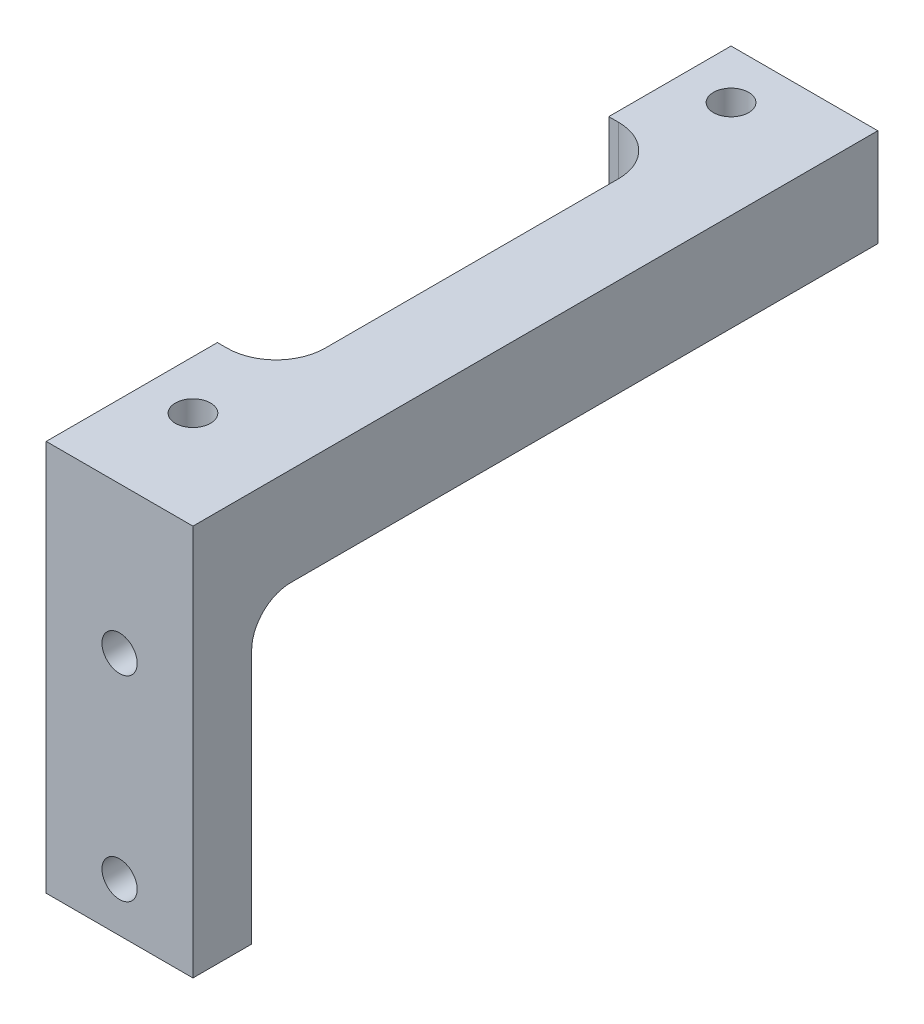
ISO-10303-21;
HEADER;
FILE_DESCRIPTION(('STEP AP214'),'2;1');
FILE_NAME('part.step','',(''),(''),'','','');
FILE_SCHEMA(('AUTOMOTIVE_DESIGN { 1 0 10303 214 1 1 1 1 }'));
ENDSEC;
DATA;
#1=APPLICATION_CONTEXT('core data for automotive mechanical design processes');
#2=APPLICATION_PROTOCOL_DEFINITION('international standard','automotive_design',2000,#1);
#3=PRODUCT_CONTEXT('',#1,'mechanical');
#4=PRODUCT('Part','Part','',(#3));
#5=PRODUCT_RELATED_PRODUCT_CATEGORY('part','',(#4));
#6=PRODUCT_DEFINITION_FORMATION('','',#4);
#7=PRODUCT_DEFINITION_CONTEXT('part definition',#1,'design');
#8=PRODUCT_DEFINITION('design','',#6,#7);
#9=PRODUCT_DEFINITION_SHAPE('','',#8);
#10=(LENGTH_UNIT() NAMED_UNIT(*) SI_UNIT(.MILLI.,.METRE.));
#11=(NAMED_UNIT(*) PLANE_ANGLE_UNIT() SI_UNIT($,.RADIAN.));
#12=(NAMED_UNIT(*) SI_UNIT($,.STERADIAN.) SOLID_ANGLE_UNIT());
#13=UNCERTAINTY_MEASURE_WITH_UNIT(LENGTH_MEASURE(1.E-05),#10,'distance_accuracy_value','');
#14=(GEOMETRIC_REPRESENTATION_CONTEXT(3) GLOBAL_UNCERTAINTY_ASSIGNED_CONTEXT((#13)) GLOBAL_UNIT_ASSIGNED_CONTEXT((#10,
#11,#12)) REPRESENTATION_CONTEXT('',''));
#15=CARTESIAN_POINT('',(0.,0.,0.));
#16=DIRECTION('',(0.,0.,1.));
#17=DIRECTION('',(1.,0.,0.));
#18=AXIS2_PLACEMENT_3D('',#15,#16,#17);
#19=CARTESIAN_POINT('',(14.2875,-12.7,44.45));
#20=DIRECTION('',(1.,0.,0.));
#21=DIRECTION('',(0.,0.,-1.));
#22=AXIS2_PLACEMENT_3D('',#19,#20,#21);
#23=PLANE('',#22);
#24=DIRECTION('',(0.,0.,-1.));
#25=VECTOR('',#24,1.);
#26=CARTESIAN_POINT('',(14.2875,12.7,44.45));
#27=LINE('',#26,#25);
#28=CARTESIAN_POINT('',(14.2875,12.7,44.45));
#29=VERTEX_POINT('',#28);
#30=CARTESIAN_POINT('',(14.2875,12.7,33.3375));
#31=VERTEX_POINT('',#30);
#32=EDGE_CURVE('E178',#29,#31,#27,.T.);
#33=ORIENTED_EDGE('',*,*,#32,.T.);
#34=DIRECTION('',(0.,-1.,0.));
#35=VECTOR('',#34,1.);
#36=CARTESIAN_POINT('',(14.2875,-12.7,33.3375));
#37=LINE('',#36,#35);
#38=CARTESIAN_POINT('',(14.2875,6.35,33.3375));
#39=VERTEX_POINT('',#38);
#40=EDGE_CURVE('E170',#31,#39,#37,.T.);
#41=ORIENTED_EDGE('',*,*,#40,.T.);
#42=DIRECTION('',(0.,0.,1.));
#43=VECTOR('',#42,1.);
#44=CARTESIAN_POINT('',(14.2875,6.35,44.45));
#45=LINE('',#44,#43);
#46=CARTESIAN_POINT('',(14.2875,6.35,38.1));
#47=VERTEX_POINT('',#46);
#48=EDGE_CURVE('E210',#39,#47,#45,.T.);
#49=ORIENTED_EDGE('',*,*,#48,.T.);
#50=CARTESIAN_POINT('',(14.2875,3.81,38.1));
#51=DIRECTION('',(1.,0.,0.));
#52=DIRECTION('',(0.,0.,-1.));
#53=AXIS2_PLACEMENT_3D('',#50,#51,#52);
#54=CIRCLE('',#53,2.54);
#55=CARTESIAN_POINT('',(14.2875,3.81,40.64));
#56=VERTEX_POINT('',#55);
#57=EDGE_CURVE('E223',#47,#56,#54,.T.);
#58=ORIENTED_EDGE('',*,*,#57,.T.);
#59=DIRECTION('',(0.,-1.,0.));
#60=VECTOR('',#59,1.);
#61=CARTESIAN_POINT('',(14.2875,-12.7,40.64));
#62=LINE('',#61,#60);
#63=CARTESIAN_POINT('',(14.2875,-12.7,40.64));
#64=VERTEX_POINT('',#63);
#65=EDGE_CURVE('E207',#56,#64,#62,.T.);
#66=ORIENTED_EDGE('',*,*,#65,.T.);
#67=DIRECTION('',(0.,0.,-1.));
#68=VECTOR('',#67,1.);
#69=CARTESIAN_POINT('',(14.2875,-12.7,44.45));
#70=LINE('',#69,#68);
#71=CARTESIAN_POINT('',(14.2875,-12.7,44.45));
#72=VERTEX_POINT('',#71);
#73=EDGE_CURVE('E191',#72,#64,#70,.T.);
#74=ORIENTED_EDGE('',*,*,#73,.F.);
#75=DIRECTION('',(0.,1.,0.));
#76=VECTOR('',#75,1.);
#77=CARTESIAN_POINT('',(14.2875,-12.7,44.45));
#78=LINE('',#77,#76);
#79=EDGE_CURVE('E184',#72,#29,#78,.T.);
#80=ORIENTED_EDGE('',*,*,#79,.T.);
#81=EDGE_LOOP('',(#33,#41,#49,#58,#66,#74,#80));
#82=FACE_BOUND('',#81,.T.);
#83=ADVANCED_FACE('F42',(#82),#23,.F.);
#84=CARTESIAN_POINT('',(-23.8125,12.7,44.45));
#85=DIRECTION('',(0.,-1.,0.));
#86=DIRECTION('',(0.,0.,-1.));
#87=AXIS2_PLACEMENT_3D('',#84,#85,#86);
#88=PLANE('',#87);
#89=CARTESIAN_POINT('',(17.4625,12.7,38.1));
#90=DIRECTION('',(0.,1.,0.));
#91=DIRECTION('',(0.,0.,1.));
#92=AXIS2_PLACEMENT_3D('',#89,#90,#91);
#93=CIRCLE('',#92,1.143);
#94=CARTESIAN_POINT('',(17.4625,12.7,39.243));
#95=VERTEX_POINT('',#94);
#96=EDGE_CURVE('E286',#95,#95,#93,.T.);
#97=ORIENTED_EDGE('',*,*,#96,.F.);
#98=EDGE_LOOP('',(#97));
#99=FACE_BOUND('',#98,.T.);
#100=CARTESIAN_POINT('',(17.4625,12.7,3.175));
#101=DIRECTION('',(0.,1.,0.));
#102=DIRECTION('',(0.,0.,1.));
#103=AXIS2_PLACEMENT_3D('',#100,#101,#102);
#104=CIRCLE('',#103,1.143);
#105=CARTESIAN_POINT('',(17.4625,12.7,4.31799999999999));
#106=VERTEX_POINT('',#105);
#107=EDGE_CURVE('E289',#106,#106,#104,.T.);
#108=ORIENTED_EDGE('',*,*,#107,.F.);
#109=EDGE_LOOP('',(#108));
#110=FACE_BOUND('',#109,.T.);
#111=DIRECTION('',(0.,0.,-1.));
#112=VECTOR('',#111,1.);
#113=CARTESIAN_POINT('',(18.0975,12.7,33.3375));
#114=LINE('',#113,#112);
#115=CARTESIAN_POINT('',(18.0975,12.7,30.1625));
#116=VERTEX_POINT('',#115);
#117=CARTESIAN_POINT('',(18.0975,12.7,11.1125));
#118=VERTEX_POINT('',#117);
#119=EDGE_CURVE('E161',#116,#118,#114,.T.);
#120=ORIENTED_EDGE('',*,*,#119,.F.);
#121=CARTESIAN_POINT('',(14.9225,12.7,30.1625));
#122=DIRECTION('',(0.,-1.,0.));
#123=DIRECTION('',(0.,0.,-1.));
#124=AXIS2_PLACEMENT_3D('',#121,#122,#123);
#125=CIRCLE('',#124,3.175);
#126=CARTESIAN_POINT('',(14.9225,12.7,33.3375));
#127=VERTEX_POINT('',#126);
#128=EDGE_CURVE('E51',#116,#127,#125,.T.);
#129=ORIENTED_EDGE('',*,*,#128,.T.);
#130=DIRECTION('',(1.,0.,0.));
#131=VECTOR('',#130,1.);
#132=CARTESIAN_POINT('',(-18.0975,12.7,33.3375));
#133=LINE('',#132,#131);
#134=EDGE_CURVE('E160',#31,#127,#133,.T.);
#135=ORIENTED_EDGE('',*,*,#134,.F.);
#136=ORIENTED_EDGE('',*,*,#32,.F.);
#137=DIRECTION('',(-1.,0.,0.));
#138=VECTOR('',#137,1.);
#139=CARTESIAN_POINT('',(-23.8125,12.7,44.45));
#140=LINE('',#139,#138);
#141=CARTESIAN_POINT('',(23.8125,12.7,44.45));
#142=VERTEX_POINT('',#141);
#143=EDGE_CURVE('E195',#142,#29,#140,.T.);
#144=ORIENTED_EDGE('',*,*,#143,.F.);
#145=DIRECTION('',(0.,0.,-1.));
#146=VECTOR('',#145,1.);
#147=CARTESIAN_POINT('',(23.8125,12.7,44.45));
#148=LINE('',#147,#146);
#149=CARTESIAN_POINT('',(23.8125,12.7,0.));
#150=VERTEX_POINT('',#149);
#151=EDGE_CURVE('E196',#142,#150,#148,.T.);
#152=ORIENTED_EDGE('',*,*,#151,.T.);
#153=DIRECTION('',(-1.,0.,0.));
#154=VECTOR('',#153,1.);
#155=CARTESIAN_POINT('',(-23.8125,12.7,0.));
#156=LINE('',#155,#154);
#157=CARTESIAN_POINT('',(14.2875,12.7,0.));
#158=VERTEX_POINT('',#157);
#159=EDGE_CURVE('E176',#150,#158,#156,.T.);
#160=ORIENTED_EDGE('',*,*,#159,.T.);
#161=CARTESIAN_POINT('',(14.2875,12.7,7.9375));
#162=VERTEX_POINT('',#161);
#163=EDGE_CURVE('E166',#162,#158,#27,.T.);
#164=ORIENTED_EDGE('',*,*,#163,.F.);
#165=DIRECTION('',(-1.,0.,0.));
#166=VECTOR('',#165,1.);
#167=CARTESIAN_POINT('',(-18.0975,12.7,7.9375));
#168=LINE('',#167,#166);
#169=CARTESIAN_POINT('',(14.9225,12.7,7.9375));
#170=VERTEX_POINT('',#169);
#171=EDGE_CURVE('E150',#170,#162,#168,.T.);
#172=ORIENTED_EDGE('',*,*,#171,.F.);
#173=CARTESIAN_POINT('',(14.9225,12.7,11.1125));
#174=DIRECTION('',(0.,-1.,0.));
#175=DIRECTION('',(0.,0.,-1.));
#176=AXIS2_PLACEMENT_3D('',#173,#174,#175);
#177=CIRCLE('',#176,3.175);
#178=EDGE_CURVE('E371',#170,#118,#177,.T.);
#179=ORIENTED_EDGE('',*,*,#178,.T.);
#180=EDGE_LOOP('',(#120,#129,#135,#136,#144,#152,#160,#164,#172,#179));
#181=FACE_BOUND('',#180,.T.);
#182=ADVANCED_FACE('F173',(#99,#110,#181),#88,.F.);
#183=CARTESIAN_POINT('',(-23.8125,-12.7,44.45));
#184=DIRECTION('',(0.,1.,0.));
#185=DIRECTION('',(0.,0.,1.));
#186=AXIS2_PLACEMENT_3D('',#183,#184,#185);
#187=PLANE('',#186);
#188=ORIENTED_EDGE('',*,*,#73,.T.);
#189=DIRECTION('',(-1.,0.,0.));
#190=VECTOR('',#189,1.);
#191=CARTESIAN_POINT('',(23.8125,-12.7,40.64));
#192=LINE('',#191,#190);
#193=CARTESIAN_POINT('',(23.8125,-12.7,40.64));
#194=VERTEX_POINT('',#193);
#195=EDGE_CURVE('E323',#194,#64,#192,.T.);
#196=ORIENTED_EDGE('',*,*,#195,.F.);
#197=DIRECTION('',(0.,0.,-1.));
#198=VECTOR('',#197,1.);
#199=CARTESIAN_POINT('',(23.8125,-12.7,44.45));
#200=LINE('',#199,#198);
#201=CARTESIAN_POINT('',(23.8125,-12.7,44.45));
#202=VERTEX_POINT('',#201);
#203=EDGE_CURVE('E179',#202,#194,#200,.T.);
#204=ORIENTED_EDGE('',*,*,#203,.F.);
#205=DIRECTION('',(1.,0.,0.));
#206=VECTOR('',#205,1.);
#207=CARTESIAN_POINT('',(-23.8125,-12.7,44.45));
#208=LINE('',#207,#206);
#209=EDGE_CURVE('E197',#72,#202,#208,.T.);
#210=ORIENTED_EDGE('',*,*,#209,.F.);
#211=EDGE_LOOP('',(#188,#196,#204,#210));
#212=FACE_BOUND('',#211,.T.);
#213=ADVANCED_FACE('F270',(#212),#187,.F.);
#214=CARTESIAN_POINT('',(0.,0.,44.45));
#215=DIRECTION('',(0.,0.,-1.));
#216=DIRECTION('',(-1.,0.,0.));
#217=AXIS2_PLACEMENT_3D('',#214,#215,#216);
#218=PLANE('',#217);
#219=CARTESIAN_POINT('',(19.05,-9.525,44.45));
#220=DIRECTION('',(0.,0.,1.));
#221=DIRECTION('',(1.,0.,0.));
#222=AXIS2_PLACEMENT_3D('',#219,#220,#221);
#223=CIRCLE('',#222,1.143);
#224=CARTESIAN_POINT('',(20.193,-9.525,44.45));
#225=VERTEX_POINT('',#224);
#226=EDGE_CURVE('E304',#225,#225,#223,.T.);
#227=ORIENTED_EDGE('',*,*,#226,.F.);
#228=EDGE_LOOP('',(#227));
#229=FACE_BOUND('',#228,.T.);
#230=CARTESIAN_POINT('',(19.05,3.175,44.45));
#231=DIRECTION('',(0.,0.,1.));
#232=DIRECTION('',(1.,0.,0.));
#233=AXIS2_PLACEMENT_3D('',#230,#231,#232);
#234=CIRCLE('',#233,1.143);
#235=CARTESIAN_POINT('',(20.193,3.175,44.45));
#236=VERTEX_POINT('',#235);
#237=EDGE_CURVE('E309',#236,#236,#234,.T.);
#238=ORIENTED_EDGE('',*,*,#237,.F.);
#239=EDGE_LOOP('',(#238));
#240=FACE_BOUND('',#239,.T.);
#241=ORIENTED_EDGE('',*,*,#143,.T.);
#242=ORIENTED_EDGE('',*,*,#79,.F.);
#243=ORIENTED_EDGE('',*,*,#209,.T.);
#244=DIRECTION('',(0.,1.,0.));
#245=VECTOR('',#244,1.);
#246=CARTESIAN_POINT('',(23.8125,-12.7,44.45));
#247=LINE('',#246,#245);
#248=EDGE_CURVE('E200',#202,#142,#247,.T.);
#249=ORIENTED_EDGE('',*,*,#248,.T.);
#250=EDGE_LOOP('',(#241,#242,#243,#249));
#251=FACE_BOUND('',#250,.T.);
#252=ADVANCED_FACE('F267',(#229,#240,#251),#218,.F.);
#253=CARTESIAN_POINT('',(0.,0.,0.));
#254=DIRECTION('',(0.,0.,-1.));
#255=DIRECTION('',(-1.,0.,0.));
#256=AXIS2_PLACEMENT_3D('',#253,#254,#255);
#257=PLANE('',#256);
#258=DIRECTION('',(-1.,0.,0.));
#259=VECTOR('',#258,1.);
#260=CARTESIAN_POINT('',(23.8125,6.35,0.));
#261=LINE('',#260,#259);
#262=CARTESIAN_POINT('',(23.8125,6.35,0.));
#263=VERTEX_POINT('',#262);
#264=CARTESIAN_POINT('',(14.2875,6.35,0.));
#265=VERTEX_POINT('',#264);
#266=EDGE_CURVE('E206',#263,#265,#261,.T.);
#267=ORIENTED_EDGE('',*,*,#266,.T.);
#268=DIRECTION('',(0.,1.,0.));
#269=VECTOR('',#268,1.);
#270=CARTESIAN_POINT('',(14.2875,-12.7,0.));
#271=LINE('',#270,#269);
#272=EDGE_CURVE('E334',#265,#158,#271,.T.);
#273=ORIENTED_EDGE('',*,*,#272,.T.);
#274=ORIENTED_EDGE('',*,*,#159,.F.);
#275=DIRECTION('',(0.,1.,0.));
#276=VECTOR('',#275,1.);
#277=CARTESIAN_POINT('',(23.8125,-12.7,0.));
#278=LINE('',#277,#276);
#279=EDGE_CURVE('E186',#263,#150,#278,.T.);
#280=ORIENTED_EDGE('',*,*,#279,.F.);
#281=EDGE_LOOP('',(#267,#273,#274,#280));
#282=FACE_BOUND('',#281,.T.);
#283=ADVANCED_FACE('F263',(#282),#257,.T.);
#284=CARTESIAN_POINT('',(23.8125,-12.7,44.45));
#285=DIRECTION('',(-1.,0.,0.));
#286=DIRECTION('',(0.,0.,1.));
#287=AXIS2_PLACEMENT_3D('',#284,#285,#286);
#288=PLANE('',#287);
#289=DIRECTION('',(0.,1.,0.));
#290=VECTOR('',#289,1.);
#291=CARTESIAN_POINT('',(23.8125,-12.7,40.64));
#292=LINE('',#291,#290);
#293=CARTESIAN_POINT('',(23.8125,3.81,40.64));
#294=VERTEX_POINT('',#293);
#295=EDGE_CURVE('E316',#194,#294,#292,.T.);
#296=ORIENTED_EDGE('',*,*,#295,.T.);
#297=CARTESIAN_POINT('',(23.8125,3.81,38.1));
#298=DIRECTION('',(-1.,0.,0.));
#299=DIRECTION('',(0.,0.,1.));
#300=AXIS2_PLACEMENT_3D('',#297,#298,#299);
#301=CIRCLE('',#300,2.54);
#302=CARTESIAN_POINT('',(23.8125,6.35,38.1));
#303=VERTEX_POINT('',#302);
#304=EDGE_CURVE('E226',#294,#303,#301,.T.);
#305=ORIENTED_EDGE('',*,*,#304,.T.);
#306=DIRECTION('',(0.,0.,-1.));
#307=VECTOR('',#306,1.);
#308=CARTESIAN_POINT('',(23.8125,6.35,0.));
#309=LINE('',#308,#307);
#310=EDGE_CURVE('E320',#303,#263,#309,.T.);
#311=ORIENTED_EDGE('',*,*,#310,.T.);
#312=ORIENTED_EDGE('',*,*,#279,.T.);
#313=ORIENTED_EDGE('',*,*,#151,.F.);
#314=ORIENTED_EDGE('',*,*,#248,.F.);
#315=ORIENTED_EDGE('',*,*,#203,.T.);
#316=EDGE_LOOP('',(#296,#305,#311,#312,#313,#314,#315));
#317=FACE_BOUND('',#316,.T.);
#318=ADVANCED_FACE('F260',(#317),#288,.F.);
#319=CARTESIAN_POINT('',(14.2875,6.35,7.9375));
#320=VERTEX_POINT('',#319);
#321=EDGE_CURVE('E168',#265,#320,#45,.T.);
#322=ORIENTED_EDGE('',*,*,#321,.T.);
#323=DIRECTION('',(0.,1.,0.));
#324=VECTOR('',#323,1.);
#325=CARTESIAN_POINT('',(14.2875,-12.7,7.9375));
#326=LINE('',#325,#324);
#327=EDGE_CURVE('E154',#320,#162,#326,.T.);
#328=ORIENTED_EDGE('',*,*,#327,.T.);
#329=ORIENTED_EDGE('',*,*,#163,.T.);
#330=ORIENTED_EDGE('',*,*,#272,.F.);
#331=EDGE_LOOP('',(#322,#328,#329,#330));
#332=FACE_BOUND('',#331,.T.);
#333=ADVANCED_FACE('F164',(#332),#23,.F.);
#334=CARTESIAN_POINT('',(23.8125,6.35,0.));
#335=DIRECTION('',(0.,1.,0.));
#336=DIRECTION('',(0.,0.,1.));
#337=AXIS2_PLACEMENT_3D('',#334,#335,#336);
#338=PLANE('',#337);
#339=CARTESIAN_POINT('',(17.4625,6.35,3.175));
#340=DIRECTION('',(0.,1.,0.));
#341=DIRECTION('',(0.,0.,1.));
#342=AXIS2_PLACEMENT_3D('',#339,#340,#341);
#343=CIRCLE('',#342,1.143);
#344=CARTESIAN_POINT('',(17.4625,6.35,4.31799999999999));
#345=VERTEX_POINT('',#344);
#346=EDGE_CURVE('E303',#345,#345,#343,.T.);
#347=ORIENTED_EDGE('',*,*,#346,.T.);
#348=EDGE_LOOP('',(#347));
#349=FACE_BOUND('',#348,.T.);
#350=ORIENTED_EDGE('',*,*,#48,.F.);
#351=DIRECTION('',(1.,0.,0.));
#352=VECTOR('',#351,1.);
#353=CARTESIAN_POINT('',(23.8125,6.35,33.3375));
#354=LINE('',#353,#352);
#355=CARTESIAN_POINT('',(14.9225,6.35,33.3375));
#356=VERTEX_POINT('',#355);
#357=EDGE_CURVE('E353',#39,#356,#354,.T.);
#358=ORIENTED_EDGE('',*,*,#357,.T.);
#359=CARTESIAN_POINT('',(14.9225,6.35,30.1625));
#360=DIRECTION('',(0.,1.,0.));
#361=DIRECTION('',(0.,0.,1.));
#362=AXIS2_PLACEMENT_3D('',#359,#360,#361);
#363=CIRCLE('',#362,3.175);
#364=CARTESIAN_POINT('',(18.0975,6.35,30.1625));
#365=VERTEX_POINT('',#364);
#366=EDGE_CURVE('E11',#356,#365,#363,.T.);
#367=ORIENTED_EDGE('',*,*,#366,.T.);
#368=DIRECTION('',(0.,0.,-1.));
#369=VECTOR('',#368,1.);
#370=CARTESIAN_POINT('',(18.0975,6.35,0.));
#371=LINE('',#370,#369);
#372=CARTESIAN_POINT('',(18.0975,6.35,11.1125));
#373=VERTEX_POINT('',#372);
#374=EDGE_CURVE('E349',#365,#373,#371,.T.);
#375=ORIENTED_EDGE('',*,*,#374,.T.);
#376=CARTESIAN_POINT('',(14.9225,6.35,11.1125));
#377=DIRECTION('',(0.,1.,0.));
#378=DIRECTION('',(0.,0.,1.));
#379=AXIS2_PLACEMENT_3D('',#376,#377,#378);
#380=CIRCLE('',#379,3.175);
#381=CARTESIAN_POINT('',(14.9225,6.35,7.9375));
#382=VERTEX_POINT('',#381);
#383=EDGE_CURVE('E347',#373,#382,#380,.T.);
#384=ORIENTED_EDGE('',*,*,#383,.T.);
#385=DIRECTION('',(-1.,0.,0.));
#386=VECTOR('',#385,1.);
#387=CARTESIAN_POINT('',(23.8125,6.35,7.9375));
#388=LINE('',#387,#386);
#389=EDGE_CURVE('E344',#382,#320,#388,.T.);
#390=ORIENTED_EDGE('',*,*,#389,.T.);
#391=ORIENTED_EDGE('',*,*,#321,.F.);
#392=ORIENTED_EDGE('',*,*,#266,.F.);
#393=ORIENTED_EDGE('',*,*,#310,.F.);
#394=DIRECTION('',(-1.,0.,0.));
#395=VECTOR('',#394,1.);
#396=CARTESIAN_POINT('',(14.2875,6.35,38.1));
#397=LINE('',#396,#395);
#398=CARTESIAN_POINT('',(18.6055,6.35,38.1));
#399=VERTEX_POINT('',#398);
#400=EDGE_CURVE('E214',#303,#399,#397,.T.);
#401=ORIENTED_EDGE('',*,*,#400,.T.);
#402=CARTESIAN_POINT('',(17.4625,6.35,38.1));
#403=DIRECTION('',(0.,1.,0.));
#404=DIRECTION('',(0.,0.,1.));
#405=AXIS2_PLACEMENT_3D('',#402,#403,#404);
#406=CIRCLE('',#405,1.143);
#407=CARTESIAN_POINT('',(16.3195,6.35,38.1));
#408=VERTEX_POINT('',#407);
#409=EDGE_CURVE('E295',#399,#408,#406,.T.);
#410=ORIENTED_EDGE('',*,*,#409,.T.);
#411=EDGE_CURVE('E213',#408,#47,#397,.T.);
#412=ORIENTED_EDGE('',*,*,#411,.T.);
#413=EDGE_LOOP('',(#350,#358,#367,#375,#384,#390,#391,#392,#393,#401,#410,#412));
#414=FACE_BOUND('',#413,.T.);
#415=ADVANCED_FACE('F252',(#349,#414),#338,.F.);
#416=CARTESIAN_POINT('',(23.8125,-12.7,40.64));
#417=DIRECTION('',(0.,0.,1.));
#418=DIRECTION('',(1.,0.,0.));
#419=AXIS2_PLACEMENT_3D('',#416,#417,#418);
#420=PLANE('',#419);
#421=CARTESIAN_POINT('',(19.05,-9.525,40.64));
#422=DIRECTION('',(0.,0.,1.));
#423=DIRECTION('',(1.,0.,0.));
#424=AXIS2_PLACEMENT_3D('',#421,#422,#423);
#425=CIRCLE('',#424,1.143);
#426=CARTESIAN_POINT('',(20.193,-9.525,40.64));
#427=VERTEX_POINT('',#426);
#428=EDGE_CURVE('E239',#427,#427,#425,.T.);
#429=ORIENTED_EDGE('',*,*,#428,.T.);
#430=EDGE_LOOP('',(#429));
#431=FACE_BOUND('',#430,.T.);
#432=DIRECTION('',(-1.,0.,0.));
#433=VECTOR('',#432,1.);
#434=CARTESIAN_POINT('',(23.8125,3.81,40.64));
#435=LINE('',#434,#433);
#436=CARTESIAN_POINT('',(18.0996190237594,3.81,40.64));
#437=VERTEX_POINT('',#436);
#438=EDGE_CURVE('E219',#56,#437,#435,.F.);
#439=ORIENTED_EDGE('',*,*,#438,.T.);
#440=CARTESIAN_POINT('',(19.05,3.175,40.64));
#441=DIRECTION('',(0.,0.,1.));
#442=DIRECTION('',(1.,0.,0.));
#443=AXIS2_PLACEMENT_3D('',#440,#441,#442);
#444=CIRCLE('',#443,1.143);
#445=CARTESIAN_POINT('',(20.0003809762406,3.81,40.64));
#446=VERTEX_POINT('',#445);
#447=EDGE_CURVE('E308',#437,#446,#444,.T.);
#448=ORIENTED_EDGE('',*,*,#447,.T.);
#449=EDGE_CURVE('E218',#446,#294,#435,.F.);
#450=ORIENTED_EDGE('',*,*,#449,.T.);
#451=ORIENTED_EDGE('',*,*,#295,.F.);
#452=ORIENTED_EDGE('',*,*,#195,.T.);
#453=ORIENTED_EDGE('',*,*,#65,.F.);
#454=EDGE_LOOP('',(#439,#448,#450,#451,#452,#453));
#455=FACE_BOUND('',#454,.T.);
#456=ADVANCED_FACE('F255',(#431,#455),#420,.F.);
#457=CARTESIAN_POINT('',(23.8125,3.81,38.1));
#458=DIRECTION('',(1.,0.,0.));
#459=DIRECTION('',(0.,0.,-1.));
#460=AXIS2_PLACEMENT_3D('',#457,#458,#459);
#461=CYLINDRICAL_SURFACE('',#460,2.54);
#462=ORIENTED_EDGE('',*,*,#411,.F.);
#463=CARTESIAN_POINT('',(16.3195,6.35,38.1));
#464=CARTESIAN_POINT('',(16.3194986657365,6.35000288838612,38.1305342874342));
#465=CARTESIAN_POINT('',(16.3207243701966,6.34944878170208,38.161052614258));
#466=CARTESIAN_POINT('',(16.3256039781701,6.34725767992865,38.2218449090373));
#467=CARTESIAN_POINT('',(16.3292570351757,6.3456210623518,38.2521189584575));
#468=CARTESIAN_POINT('',(16.3437726329065,6.33915445348556,38.3419965938371));
#469=CARTESIAN_POINT('',(16.3581921940472,6.33276708519985,38.4009557620108));
#470=CARTESIAN_POINT('',(16.3959227983405,6.3164819353201,38.5153223070017));
#471=CARTESIAN_POINT('',(16.419225754061,6.30658734726825,38.5707328610385));
#472=CARTESIAN_POINT('',(16.4739454177578,6.28422067546021,38.6768680259539));
#473=CARTESIAN_POINT('',(16.5053691721506,6.27174635515778,38.7275885151065));
#474=CARTESIAN_POINT('',(16.5772763573435,6.24466777116817,38.825753786401));
#475=CARTESIAN_POINT('',(16.6181416372763,6.22998710121369,38.8728973559971));
#476=CARTESIAN_POINT('',(16.7069580109812,6.20044792518947,38.9599268436103));
#477=CARTESIAN_POINT('',(16.7549126402643,6.18558933380653,38.9998091180913));
#478=CARTESIAN_POINT('',(16.8600018173756,6.15637213033484,39.0735529532226));
#479=CARTESIAN_POINT('',(16.9175132225406,6.14209614742485,39.1069137724005));
#480=CARTESIAN_POINT('',(17.0380579606569,6.11691195936876,39.1633528232744));
#481=CARTESIAN_POINT('',(17.1010878451137,6.10600167001582,39.1864374224631));
#482=CARTESIAN_POINT('',(17.2273934818973,6.08963227597977,39.2203644659886));
#483=CARTESIAN_POINT('',(17.290476012059,6.08391296879384,39.2317953174589));
#484=CARTESIAN_POINT('',(17.4179040133172,6.07784089926287,39.2439181519987));
#485=CARTESIAN_POINT('',(17.4822486061744,6.07748452898434,39.2446173548265));
#486=CARTESIAN_POINT('',(17.6040201968515,6.08196252477119,39.235694483485));
#487=CARTESIAN_POINT('',(17.6615377957117,6.08632110856438,39.2270185363571));
#488=CARTESIAN_POINT('',(17.7741905699245,6.0989223099819,39.2011988087691));
#489=CARTESIAN_POINT('',(17.8293252359542,6.10716575350964,39.1840532276662));
#490=CARTESIAN_POINT('',(17.9371434976272,6.1267991302833,39.141441574238));
#491=CARTESIAN_POINT('',(17.9897433922059,6.13825604583393,39.115795992869));
#492=CARTESIAN_POINT('',(18.0901198932502,6.16301655934816,39.0570412519714));
#493=CARTESIAN_POINT('',(18.1378943379796,6.17632097868588,39.0239287686556));
#494=CARTESIAN_POINT('',(18.2322960696288,6.20489320787105,38.9473007724596));
#495=CARTESIAN_POINT('',(18.278330069545,6.22022425863122,38.903075789693));
#496=CARTESIAN_POINT('',(18.3625501157982,6.25001788123482,38.8074046603163));
#497=CARTESIAN_POINT('',(18.4007330158249,6.26448010326015,38.7559556325322));
#498=CARTESIAN_POINT('',(18.4692531127606,6.29146701855132,38.6452225222841));
#499=CARTESIAN_POINT('',(18.499305782566,6.30391646832275,38.5857429099057));
#500=CARTESIAN_POINT('',(18.5487352472456,6.3248665401722,38.4618966557652));
#501=CARTESIAN_POINT('',(18.5681295225465,6.3333736243595,38.3975382140888));
#502=CARTESIAN_POINT('',(18.5896210231712,6.34288477846016,38.2938015683215));
#503=CARTESIAN_POINT('',(18.5955634345117,6.34554001964568,38.2553316677414));
#504=CARTESIAN_POINT('',(18.6035058552592,6.3491023452927,38.1779168358743));
#505=CARTESIAN_POINT('',(18.6055067525357,6.35000982345608,38.1389720135579));
#506=CARTESIAN_POINT('',(18.6055,6.35,38.1));
#507=B_SPLINE_CURVE_WITH_KNOTS('',3,(#463,#464,#465,#466,#467,#468,#469,#470,#471,#472,#473,
#474,#475,#476,#477,#478,#479,#480,#481,#482,#483,#484,#485,#486,#487,#488,#489,#490,#491,#492,
#493,#494,#495,#496,#497,#498,#499,#500,#501,#502,#503,#504,#505,#506),.UNSPECIFIED.,.F.,.F.,(4,
2,2,2,2,2,2,2,2,2,2,2,2,2,2,2,2,2,2,2,2,4),(0.,0.0915422680688189,0.183052628702821,
0.365185330438426,0.547152613237371,0.729278322298012,0.920740381310048,1.11229824800259,
1.31527720707648,1.51813021787046,1.71014043626756,1.90202147337852,2.07620262383167,
2.25042082111694,2.4285815039115,2.60682164954432,2.80289957475028,2.9990559252422,
3.20138164062742,3.40337453144015,3.52020390858844,3.63700696561963),.UNSPECIFIED.);
#508=EDGE_CURVE('E238',#408,#399,#507,.T.);
#509=ORIENTED_EDGE('',*,*,#508,.T.);
#510=ORIENTED_EDGE('',*,*,#400,.F.);
#511=ORIENTED_EDGE('',*,*,#304,.F.);
#512=ORIENTED_EDGE('',*,*,#449,.F.);
#513=CARTESIAN_POINT('',(20.193,3.175,40.5593444248417));
#514=CARTESIAN_POINT('',(20.1929976639089,3.23308586850009,40.5743402416249));
#515=CARTESIAN_POINT('',(20.1885546327744,3.29173632925226,40.5872714228735));
#516=CARTESIAN_POINT('',(20.170464887893,3.40844477753045,40.6087603231855));
#517=CARTESIAN_POINT('',(20.1568142671747,3.46650250292629,40.6173161829985));
#518=CARTESIAN_POINT('',(20.120435877933,3.58018810678426,40.6302293931123));
#519=CARTESIAN_POINT('',(20.0977083725239,3.63581605562718,40.6345868651006));
#520=CARTESIAN_POINT('',(20.0437269256983,3.74293946615986,40.6396816639595));
#521=CARTESIAN_POINT('',(20.0124720145336,3.79443445698147,40.6404185789141));
#522=CARTESIAN_POINT('',(19.9421913562461,3.89198606717604,40.6391471855582));
#523=CARTESIAN_POINT('',(19.9031434443376,3.93802656365968,40.6371309489478));
#524=CARTESIAN_POINT('',(19.8183599961301,4.02334632727286,40.6313860483373));
#525=CARTESIAN_POINT('',(19.7726228249861,4.06262393643899,40.6276569652417));
#526=CARTESIAN_POINT('',(19.6731078908576,4.1352976256996,40.6193629783194));
#527=CARTESIAN_POINT('',(19.619039240425,4.16829223151399,40.6147651767032));
#528=CARTESIAN_POINT('',(19.5061670587736,4.22492778703552,40.6060445991589));
#529=CARTESIAN_POINT('',(19.4473631333625,4.24856795705347,40.6019218628476));
#530=CARTESIAN_POINT('',(19.3254264842757,4.28618637659287,40.595039692646));
#531=CARTESIAN_POINT('',(19.2622328426706,4.29997302417657,40.5923075765992));
#532=CARTESIAN_POINT('',(19.1343756884283,4.31670281933585,40.588961063246));
#533=CARTESIAN_POINT('',(19.0697123999705,4.31964760970231,40.5883463451059));
#534=CARTESIAN_POINT('',(18.942051526624,4.31464918374397,40.5893641805289));
#535=CARTESIAN_POINT('',(18.8790454997998,4.30690988380667,40.590954648442));
#536=CARTESIAN_POINT('',(18.7552462469073,4.28114995073692,40.5959542305618));
#537=CARTESIAN_POINT('',(18.6944532345909,4.26312832723776,40.5993635199507));
#538=CARTESIAN_POINT('',(18.5765590450567,4.21726492302863,40.6072444573604));
#539=CARTESIAN_POINT('',(18.5194695953047,4.18939359318974,40.6117192886839));
#540=CARTESIAN_POINT('',(18.4106748783645,4.12459063479308,40.6206544942098));
#541=CARTESIAN_POINT('',(18.3589705333312,4.08765745809028,40.62511486581));
#542=CARTESIAN_POINT('',(18.2614967808472,4.00497852476028,40.6328506924286));
#543=CARTESIAN_POINT('',(18.2158441120749,3.9590927429366,40.6361045581336));
#544=CARTESIAN_POINT('',(18.132886630108,3.86021048930232,40.6399843130126));
#545=CARTESIAN_POINT('',(18.095579528964,3.80721597275043,40.6406109232903));
#546=CARTESIAN_POINT('',(18.0314065913478,3.69734701231416,40.6380775949307));
#547=CARTESIAN_POINT('',(18.004272075113,3.64062736077523,40.6350256988775));
#548=CARTESIAN_POINT('',(17.9597558735847,3.52387825523894,40.6245123112393));
#549=CARTESIAN_POINT('',(17.9423703957224,3.46385009831072,40.6170525367288));
#550=CARTESIAN_POINT('',(17.918236771798,3.34541459292632,40.5978369424645));
#551=CARTESIAN_POINT('',(17.9110236482306,3.287065209603,40.5863014203943));
#552=CARTESIAN_POINT('',(17.9055294492879,3.17094518168283,40.5590175935416));
#553=CARTESIAN_POINT('',(17.9072495379818,3.11317461349299,40.543268739982));
#554=CARTESIAN_POINT('',(17.919212385318,2.99845113424185,40.5076290032287));
#555=CARTESIAN_POINT('',(17.9296420067857,2.94154425082015,40.4876545375567));
#556=CARTESIAN_POINT('',(17.9584746596887,2.83107535347666,40.4445316038175));
#557=CARTESIAN_POINT('',(17.9768797783303,2.77751421934638,40.421382305974));
#558=CARTESIAN_POINT('',(18.0233480828227,2.66871956111925,40.3700424746317));
#559=CARTESIAN_POINT('',(18.052268532929,2.61398272256404,40.3415779073439));
#560=CARTESIAN_POINT('',(18.1180792603389,2.51035893401114,40.2831355808679));
#561=CARTESIAN_POINT('',(18.1549796327502,2.46147951688158,40.2531559421738));
#562=CARTESIAN_POINT('',(18.241649289642,2.36392404503734,40.1890940807107));
#563=CARTESIAN_POINT('',(18.2924891714908,2.31619395701816,40.1550126999479));
#564=CARTESIAN_POINT('',(18.4030887504175,2.23008914650886,40.0895718841766));
#565=CARTESIAN_POINT('',(18.4628383464292,2.19170395766541,40.0582094295485));
#566=CARTESIAN_POINT('',(18.571931399875,2.13554238768796,40.0101661185134));
#567=CARTESIAN_POINT('',(18.6191550870281,2.1150260540265,39.9918819539635));
#568=CARTESIAN_POINT('',(18.7173690576669,2.08023483411362,39.9601257793608));
#569=CARTESIAN_POINT('',(18.7683536920955,2.06595080126026,39.9466467226279));
#570=CARTESIAN_POINT('',(18.8736687190914,2.04439460486004,39.9260532141637));
#571=CARTESIAN_POINT('',(18.928028433763,2.03719703999826,39.9190065306667));
#572=CARTESIAN_POINT('',(19.0376548817159,2.03075233803165,39.9127060639461));
#573=CARTESIAN_POINT('',(19.0929207842989,2.03149828595745,39.913445502758));
#574=CARTESIAN_POINT('',(19.1940621200468,2.04014818185708,39.9218799556948));
#575=CARTESIAN_POINT('',(19.2401258214915,2.04698606027107,39.928538734319));
#576=CARTESIAN_POINT('',(19.3301994110306,2.06591980208569,39.9466062571074));
#577=CARTESIAN_POINT('',(19.3742073190236,2.0780206235498,39.9580194798644));
#578=CARTESIAN_POINT('',(19.4751043389528,2.11221057894773,39.9893975524593));
#579=CARTESIAN_POINT('',(19.5308010502739,2.13633514206319,40.0109635440476));
#580=CARTESIAN_POINT('',(19.636337377692,2.19202898230209,40.0583430170325));
#581=CARTESIAN_POINT('',(19.686167801828,2.2236097159015,40.0841630161173));
#582=CARTESIAN_POINT('',(19.7807372111571,2.29407801617309,40.1385300560779));
#583=CARTESIAN_POINT('',(19.8253388669199,2.33311202086686,40.1671248560699));
#584=CARTESIAN_POINT('',(19.9078720226306,2.41738237083938,40.2248123532537));
#585=CARTESIAN_POINT('',(19.9458007252485,2.46262130317485,40.2539052536703));
#586=CARTESIAN_POINT('',(20.0214496384111,2.56854775781108,40.3169620510936));
#587=CARTESIAN_POINT('',(20.0575772758109,2.63050945209594,40.3507215349086));
#588=CARTESIAN_POINT('',(20.118041534471,2.76157477702853,40.414669072882));
#589=CARTESIAN_POINT('',(20.1423987600103,2.83066566865162,40.4448632975266));
#590=CARTESIAN_POINT('',(20.1707852736895,2.94624257061453,40.4890874159703));
#591=CARTESIAN_POINT('',(20.1790364198774,2.99106584313649,40.5048359474772));
#592=CARTESIAN_POINT('',(20.1901440786216,3.08213844506947,40.5339472701961));
#593=CARTESIAN_POINT('',(20.1930018746591,3.12838743253306,40.5473106283336));
#594=CARTESIAN_POINT('',(20.193,3.175,40.5593444248417));
#595=B_SPLINE_CURVE_WITH_KNOTS('',3,(#513,#514,#515,#516,#517,#518,#519,#520,#521,#522,#523,
#524,#525,#526,#527,#528,#529,#530,#531,#532,#533,#534,#535,#536,#537,#538,#539,#540,#541,#542,
#543,#544,#545,#546,#547,#548,#549,#550,#551,#552,#553,#554,#555,#556,#557,#558,#559,#560,#561,
#562,#563,#564,#565,#566,#567,#568,#569,#570,#571,#572,#573,#574,#575,#576,#577,#578,#579,#580,
#581,#582,#583,#584,#585,#586,#587,#588,#589,#590,#591,#592,#593,#594),.UNSPECIFIED.,.T.,.F.,(4,
2,2,2,2,2,2,2,2,2,2,2,2,2,2,2,2,2,2,2,2,2,2,2,2,2,2,2,2,2,2,2,2,2,2,2,2,2,2,2,4),(0.,
0.179804349596566,0.359685041947603,0.539560520422151,0.719456463115287,0.899871549358791,
1.08033080268812,1.26998170754805,1.45964841642165,1.65290965614457,1.84614161113641,
2.0357360958133,2.22534884482198,2.4155353298192,2.60575432932831,2.79922934222238,
2.99265124848112,3.18052788890916,3.36833139081427,3.54723657969335,3.72616508193337,
3.90903417592513,4.09195115611777,4.29556829830813,4.49944455187857,4.73126217080687,
4.96281894539418,5.12616094813152,5.28926241509564,5.45406304451614,5.61872022378942,
5.75922359014578,5.89985960826497,6.09205411489079,6.28454587440523,6.48130412504951,
6.67814466205411,6.91478264715377,7.15100487977341,7.29532806577022,7.43961690215745),.UNSPECIFIED.);
#596=EDGE_CURVE('E229',#446,#437,#595,.T.);
#597=ORIENTED_EDGE('',*,*,#596,.T.);
#598=ORIENTED_EDGE('',*,*,#438,.F.);
#599=ORIENTED_EDGE('',*,*,#57,.F.);
#600=EDGE_LOOP('',(#462,#509,#510,#511,#512,#597,#598,#599));
#601=FACE_BOUND('',#600,.T.);
#602=ADVANCED_FACE('F241',(#601),#461,.F.);
#603=CARTESIAN_POINT('',(19.05,3.175,0.));
#604=DIRECTION('',(0.,0.,1.));
#605=DIRECTION('',(1.,0.,0.));
#606=AXIS2_PLACEMENT_3D('',#603,#604,#605);
#607=CYLINDRICAL_SURFACE('',#606,1.143);
#608=ORIENTED_EDGE('',*,*,#237,.T.);
#609=EDGE_LOOP('',(#608));
#610=FACE_BOUND('',#609,.T.);
#611=ORIENTED_EDGE('',*,*,#596,.F.);
#612=ORIENTED_EDGE('',*,*,#447,.F.);
#613=EDGE_LOOP('',(#611,#612));
#614=FACE_BOUND('',#613,.T.);
#615=ADVANCED_FACE('F244',(#610,#614),#607,.F.);
#616=CARTESIAN_POINT('',(19.05,-9.525,0.));
#617=DIRECTION('',(0.,0.,1.));
#618=DIRECTION('',(1.,0.,0.));
#619=AXIS2_PLACEMENT_3D('',#616,#617,#618);
#620=CYLINDRICAL_SURFACE('',#619,1.143);
#621=ORIENTED_EDGE('',*,*,#226,.T.);
#622=EDGE_LOOP('',(#621));
#623=FACE_BOUND('',#622,.T.);
#624=ORIENTED_EDGE('',*,*,#428,.F.);
#625=EDGE_LOOP('',(#624));
#626=FACE_BOUND('',#625,.T.);
#627=ADVANCED_FACE('F249',(#623,#626),#620,.F.);
#628=CARTESIAN_POINT('',(17.4625,2.54,38.1));
#629=DIRECTION('',(0.,1.,0.));
#630=DIRECTION('',(0.,0.,1.));
#631=AXIS2_PLACEMENT_3D('',#628,#629,#630);
#632=CYLINDRICAL_SURFACE('',#631,1.143);
#633=ORIENTED_EDGE('',*,*,#96,.T.);
#634=EDGE_LOOP('',(#633));
#635=FACE_BOUND('',#634,.T.);
#636=ORIENTED_EDGE('',*,*,#508,.F.);
#637=ORIENTED_EDGE('',*,*,#409,.F.);
#638=EDGE_LOOP('',(#636,#637));
#639=FACE_BOUND('',#638,.T.);
#640=ADVANCED_FACE('F402',(#635,#639),#632,.F.);
#641=CARTESIAN_POINT('',(17.4625,2.54,3.175));
#642=DIRECTION('',(0.,1.,0.));
#643=DIRECTION('',(0.,0.,1.));
#644=AXIS2_PLACEMENT_3D('',#641,#642,#643);
#645=CYLINDRICAL_SURFACE('',#644,1.143);
#646=ORIENTED_EDGE('',*,*,#107,.T.);
#647=EDGE_LOOP('',(#646));
#648=FACE_BOUND('',#647,.T.);
#649=ORIENTED_EDGE('',*,*,#346,.F.);
#650=EDGE_LOOP('',(#649));
#651=FACE_BOUND('',#650,.T.);
#652=ADVANCED_FACE('F401',(#648,#651),#645,.F.);
#653=CARTESIAN_POINT('',(18.0975,-12.7,33.3375));
#654=DIRECTION('',(1.,0.,0.));
#655=DIRECTION('',(0.,0.,-1.));
#656=AXIS2_PLACEMENT_3D('',#653,#654,#655);
#657=PLANE('',#656);
#658=ORIENTED_EDGE('',*,*,#119,.T.);
#659=DIRECTION('',(0.,1.,0.));
#660=VECTOR('',#659,1.);
#661=CARTESIAN_POINT('',(18.0975,6.35,11.1125));
#662=LINE('',#661,#660);
#663=EDGE_CURVE('E366',#118,#373,#662,.F.);
#664=ORIENTED_EDGE('',*,*,#663,.T.);
#665=ORIENTED_EDGE('',*,*,#374,.F.);
#666=DIRECTION('',(0.,1.,0.));
#667=VECTOR('',#666,1.);
#668=CARTESIAN_POINT('',(18.0975,12.7,30.1625));
#669=LINE('',#668,#667);
#670=EDGE_CURVE('E362',#365,#116,#669,.T.);
#671=ORIENTED_EDGE('',*,*,#670,.T.);
#672=EDGE_LOOP('',(#658,#664,#665,#671));
#673=FACE_BOUND('',#672,.T.);
#674=ADVANCED_FACE('F380',(#673),#657,.F.);
#675=CARTESIAN_POINT('',(-18.0975,-12.7,33.3375));
#676=DIRECTION('',(0.,0.,1.));
#677=DIRECTION('',(1.,0.,0.));
#678=AXIS2_PLACEMENT_3D('',#675,#676,#677);
#679=PLANE('',#678);
#680=ORIENTED_EDGE('',*,*,#134,.T.);
#681=DIRECTION('',(0.,1.,0.));
#682=VECTOR('',#681,1.);
#683=CARTESIAN_POINT('',(14.9225,6.35,33.3375));
#684=LINE('',#683,#682);
#685=EDGE_CURVE('E58',#127,#356,#684,.F.);
#686=ORIENTED_EDGE('',*,*,#685,.T.);
#687=ORIENTED_EDGE('',*,*,#357,.F.);
#688=ORIENTED_EDGE('',*,*,#40,.F.);
#689=EDGE_LOOP('',(#680,#686,#687,#688));
#690=FACE_BOUND('',#689,.T.);
#691=ADVANCED_FACE('F392',(#690),#679,.F.);
#692=CARTESIAN_POINT('',(-18.0975,-12.7,7.9375));
#693=DIRECTION('',(0.,0.,-1.));
#694=DIRECTION('',(-1.,0.,0.));
#695=AXIS2_PLACEMENT_3D('',#692,#693,#694);
#696=PLANE('',#695);
#697=ORIENTED_EDGE('',*,*,#389,.F.);
#698=DIRECTION('',(0.,1.,0.));
#699=VECTOR('',#698,1.);
#700=CARTESIAN_POINT('',(14.9225,12.7,7.9375));
#701=LINE('',#700,#699);
#702=EDGE_CURVE('E157',#382,#170,#701,.T.);
#703=ORIENTED_EDGE('',*,*,#702,.T.);
#704=ORIENTED_EDGE('',*,*,#171,.T.);
#705=ORIENTED_EDGE('',*,*,#327,.F.);
#706=EDGE_LOOP('',(#697,#703,#704,#705));
#707=FACE_BOUND('',#706,.T.);
#708=ADVANCED_FACE('F153',(#707),#696,.F.);
#709=CARTESIAN_POINT('',(14.9225,-12.7,11.1125));
#710=DIRECTION('',(0.,-1.,0.));
#711=DIRECTION('',(0.,0.,-1.));
#712=AXIS2_PLACEMENT_3D('',#709,#710,#711);
#713=CYLINDRICAL_SURFACE('',#712,3.175);
#714=ORIENTED_EDGE('',*,*,#383,.F.);
#715=ORIENTED_EDGE('',*,*,#663,.F.);
#716=ORIENTED_EDGE('',*,*,#178,.F.);
#717=ORIENTED_EDGE('',*,*,#702,.F.);
#718=EDGE_LOOP('',(#714,#715,#716,#717));
#719=FACE_BOUND('',#718,.T.);
#720=ADVANCED_FACE('F385',(#719),#713,.F.);
#721=CARTESIAN_POINT('',(14.9225,-12.7,30.1625));
#722=DIRECTION('',(0.,-1.,0.));
#723=DIRECTION('',(0.,0.,-1.));
#724=AXIS2_PLACEMENT_3D('',#721,#722,#723);
#725=CYLINDRICAL_SURFACE('',#724,3.175);
#726=ORIENTED_EDGE('',*,*,#366,.F.);
#727=ORIENTED_EDGE('',*,*,#685,.F.);
#728=ORIENTED_EDGE('',*,*,#128,.F.);
#729=ORIENTED_EDGE('',*,*,#670,.F.);
#730=EDGE_LOOP('',(#726,#727,#728,#729));
#731=FACE_BOUND('',#730,.T.);
#732=ADVANCED_FACE('F44',(#731),#725,.F.);
#733=CLOSED_SHELL('',(#83,#182,#213,#252,#283,#318,#333,#415,#456,#602,#615,#627,#640,#652,#674,
#691,#708,#720,#732));
#734=MANIFOLD_SOLID_BREP('B2',#733);
#735=ADVANCED_BREP_SHAPE_REPRESENTATION('',(#18,#734),#14);
#736=SHAPE_DEFINITION_REPRESENTATION(#9,#735);
ENDSEC;
END-ISO-10303-21;
